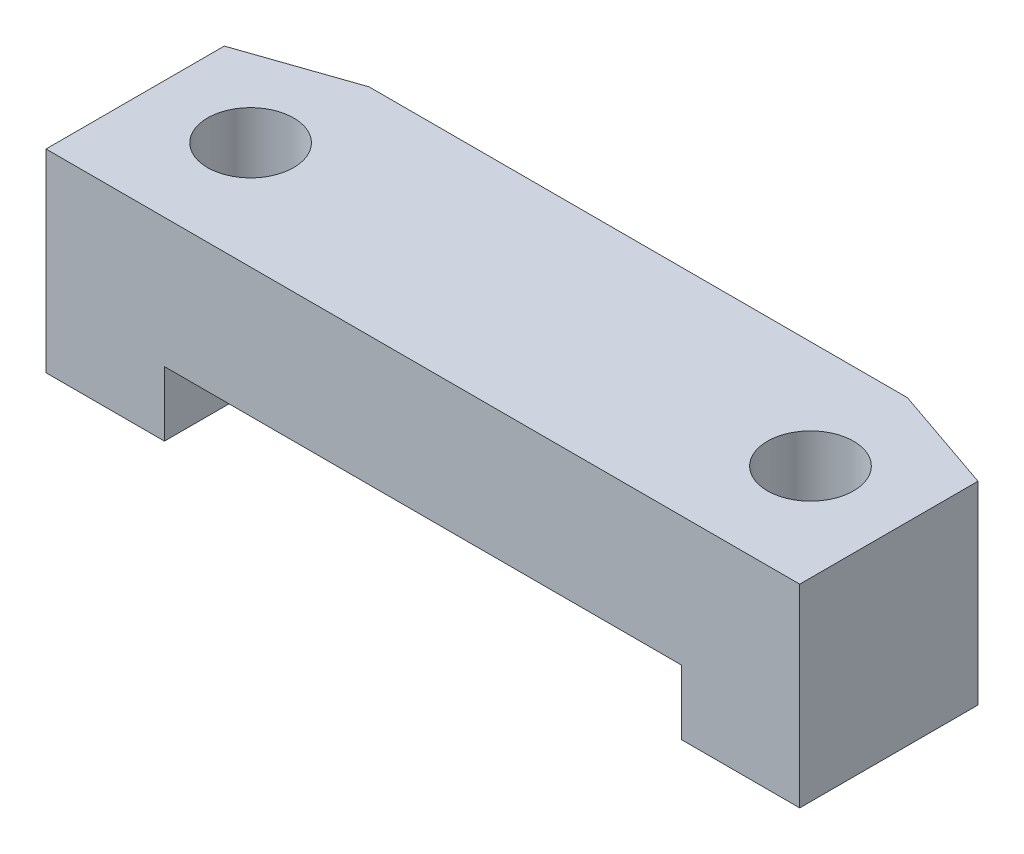
ISO-10303-21;
HEADER;
FILE_DESCRIPTION(('STEP AP214'),'2;1');
FILE_NAME('part.step','',(''),(''),'','','');
FILE_SCHEMA(('AUTOMOTIVE_DESIGN { 1 0 10303 214 1 1 1 1 }'));
ENDSEC;
DATA;
#1=APPLICATION_CONTEXT('core data for automotive mechanical design processes');
#2=APPLICATION_PROTOCOL_DEFINITION('international standard','automotive_design',2000,#1);
#3=PRODUCT_CONTEXT('',#1,'mechanical');
#4=PRODUCT('Part','Part','',(#3));
#5=PRODUCT_RELATED_PRODUCT_CATEGORY('part','',(#4));
#6=PRODUCT_DEFINITION_FORMATION('','',#4);
#7=PRODUCT_DEFINITION_CONTEXT('part definition',#1,'design');
#8=PRODUCT_DEFINITION('design','',#6,#7);
#9=PRODUCT_DEFINITION_SHAPE('','',#8);
#10=(LENGTH_UNIT() NAMED_UNIT(*) SI_UNIT(.MILLI.,.METRE.));
#11=(NAMED_UNIT(*) PLANE_ANGLE_UNIT() SI_UNIT($,.RADIAN.));
#12=(NAMED_UNIT(*) SI_UNIT($,.STERADIAN.) SOLID_ANGLE_UNIT());
#13=UNCERTAINTY_MEASURE_WITH_UNIT(LENGTH_MEASURE(1.E-05),#10,'distance_accuracy_value','');
#14=(GEOMETRIC_REPRESENTATION_CONTEXT(3) GLOBAL_UNCERTAINTY_ASSIGNED_CONTEXT((#13)) GLOBAL_UNIT_ASSIGNED_CONTEXT((#10,
#11,#12)) REPRESENTATION_CONTEXT('',''));
#15=CARTESIAN_POINT('',(0.,0.,0.));
#16=DIRECTION('',(0.,0.,1.));
#17=DIRECTION('',(1.,0.,0.));
#18=AXIS2_PLACEMENT_3D('',#15,#16,#17);
#19=CARTESIAN_POINT('',(0.,0.,5.));
#20=DIRECTION('',(0.,1.,0.));
#21=DIRECTION('',(0.,0.,1.));
#22=AXIS2_PLACEMENT_3D('',#19,#20,#21);
#23=PLANE('',#22);
#24=DIRECTION('',(1.,0.,0.));
#25=VECTOR('',#24,1.);
#26=CARTESIAN_POINT('',(0.,0.,0.));
#27=LINE('',#26,#25);
#28=CARTESIAN_POINT('',(14.75,0.,0.));
#29=VERTEX_POINT('',#28);
#30=CARTESIAN_POINT('',(15.,0.,0.));
#31=VERTEX_POINT('',#30);
#32=EDGE_CURVE('E170',#29,#31,#27,.T.);
#33=ORIENTED_EDGE('',*,*,#32,.T.);
#34=DIRECTION('',(0.945518575599317,0.,0.325568154457155));
#35=VECTOR('',#34,1.);
#36=CARTESIAN_POINT('',(17.5,0.,0.860819033224168));
#37=LINE('',#36,#35);
#38=CARTESIAN_POINT('',(17.5,0.,0.860819033224168));
#39=VERTEX_POINT('',#38);
#40=EDGE_CURVE('E13',#31,#39,#37,.T.);
#41=ORIENTED_EDGE('',*,*,#40,.T.);
#42=DIRECTION('',(0.,0.,-1.));
#43=VECTOR('',#42,1.);
#44=CARTESIAN_POINT('',(17.5,0.,5.));
#45=LINE('',#44,#43);
#46=CARTESIAN_POINT('',(17.5,0.,5.));
#47=VERTEX_POINT('',#46);
#48=EDGE_CURVE('E227',#47,#39,#45,.T.);
#49=ORIENTED_EDGE('',*,*,#48,.F.);
#50=DIRECTION('',(1.,0.,0.));
#51=VECTOR('',#50,1.);
#52=CARTESIAN_POINT('',(0.,0.,5.));
#53=LINE('',#52,#51);
#54=CARTESIAN_POINT('',(14.75,0.,5.));
#55=VERTEX_POINT('',#54);
#56=EDGE_CURVE('E208',#55,#47,#53,.T.);
#57=ORIENTED_EDGE('',*,*,#56,.F.);
#58=DIRECTION('',(0.,0.,1.));
#59=VECTOR('',#58,1.);
#60=CARTESIAN_POINT('',(14.75,0.,0.));
#61=LINE('',#60,#59);
#62=CARTESIAN_POINT('',(14.75,0.,3.36602540378444));
#63=VERTEX_POINT('',#62);
#64=EDGE_CURVE('E186',#63,#55,#61,.T.);
#65=ORIENTED_EDGE('',*,*,#64,.F.);
#66=CARTESIAN_POINT('',(15.25,0.,2.5));
#67=DIRECTION('',(0.,1.,0.));
#68=DIRECTION('',(0.,0.,1.));
#69=AXIS2_PLACEMENT_3D('',#66,#67,#68);
#70=CIRCLE('',#69,1.);
#71=CARTESIAN_POINT('',(14.75,0.,1.63397459621556));
#72=VERTEX_POINT('',#71);
#73=EDGE_CURVE('E194',#63,#72,#70,.T.);
#74=ORIENTED_EDGE('',*,*,#73,.T.);
#75=EDGE_CURVE('E183',#29,#72,#61,.T.);
#76=ORIENTED_EDGE('',*,*,#75,.F.);
#77=EDGE_LOOP('',(#33,#41,#49,#57,#65,#74,#76));
#78=FACE_BOUND('',#77,.T.);
#79=ADVANCED_FACE('F43',(#78),#23,.F.);
#80=DIRECTION('',(0.,0.,-1.));
#81=VECTOR('',#80,1.);
#82=CARTESIAN_POINT('',(0.,0.,5.));
#83=LINE('',#82,#81);
#84=CARTESIAN_POINT('',(0.,0.,5.));
#85=VERTEX_POINT('',#84);
#86=CARTESIAN_POINT('',(0.,0.,0.860819033224167));
#87=VERTEX_POINT('',#86);
#88=EDGE_CURVE('E229',#85,#87,#83,.T.);
#89=ORIENTED_EDGE('',*,*,#88,.T.);
#90=DIRECTION('',(0.945518575599318,0.,-0.325568154457155));
#91=VECTOR('',#90,1.);
#92=CARTESIAN_POINT('',(0.,0.,0.860819033224167));
#93=LINE('',#92,#91);
#94=CARTESIAN_POINT('',(2.50000000000003,0.,0.));
#95=VERTEX_POINT('',#94);
#96=EDGE_CURVE('E244',#87,#95,#93,.T.);
#97=ORIENTED_EDGE('',*,*,#96,.T.);
#98=CARTESIAN_POINT('',(2.75,0.,0.));
#99=VERTEX_POINT('',#98);
#100=EDGE_CURVE('E218',#95,#99,#27,.T.);
#101=ORIENTED_EDGE('',*,*,#100,.T.);
#102=DIRECTION('',(0.,0.,1.));
#103=VECTOR('',#102,1.);
#104=CARTESIAN_POINT('',(2.75,0.,0.));
#105=LINE('',#104,#103);
#106=CARTESIAN_POINT('',(2.75,0.,1.63397459621556));
#107=VERTEX_POINT('',#106);
#108=EDGE_CURVE('E187',#99,#107,#105,.T.);
#109=ORIENTED_EDGE('',*,*,#108,.T.);
#110=CARTESIAN_POINT('',(2.25,0.,2.5));
#111=DIRECTION('',(0.,1.,0.));
#112=DIRECTION('',(0.,0.,1.));
#113=AXIS2_PLACEMENT_3D('',#110,#111,#112);
#114=CIRCLE('',#113,1.);
#115=CARTESIAN_POINT('',(2.75,0.,3.36602540378444));
#116=VERTEX_POINT('',#115);
#117=EDGE_CURVE('E200',#107,#116,#114,.T.);
#118=ORIENTED_EDGE('',*,*,#117,.T.);
#119=CARTESIAN_POINT('',(2.75,0.,5.));
#120=VERTEX_POINT('',#119);
#121=EDGE_CURVE('E190',#116,#120,#105,.T.);
#122=ORIENTED_EDGE('',*,*,#121,.T.);
#123=EDGE_CURVE('E210',#85,#120,#53,.T.);
#124=ORIENTED_EDGE('',*,*,#123,.F.);
#125=EDGE_LOOP('',(#89,#97,#101,#109,#118,#122,#124));
#126=FACE_BOUND('',#125,.T.);
#127=ADVANCED_FACE('F269',(#126),#23,.F.);
#128=CARTESIAN_POINT('',(0.,4.5,5.));
#129=DIRECTION('',(0.,0.,-1.));
#130=DIRECTION('',(-1.,0.,0.));
#131=AXIS2_PLACEMENT_3D('',#128,#129,#130);
#132=PLANE('',#131);
#133=DIRECTION('',(0.,-1.,0.));
#134=VECTOR('',#133,1.);
#135=CARTESIAN_POINT('',(14.75,-11.946046929336,5.));
#136=LINE('',#135,#134);
#137=CARTESIAN_POINT('',(14.75,1.5,5.));
#138=VERTEX_POINT('',#137);
#139=EDGE_CURVE('E178',#138,#55,#136,.T.);
#140=ORIENTED_EDGE('',*,*,#139,.T.);
#141=ORIENTED_EDGE('',*,*,#56,.T.);
#142=DIRECTION('',(0.,1.,0.));
#143=VECTOR('',#142,1.);
#144=CARTESIAN_POINT('',(17.5,0.,5.));
#145=LINE('',#144,#143);
#146=CARTESIAN_POINT('',(17.5,4.5,5.));
#147=VERTEX_POINT('',#146);
#148=EDGE_CURVE('E213',#47,#147,#145,.T.);
#149=ORIENTED_EDGE('',*,*,#148,.T.);
#150=DIRECTION('',(-1.,0.,0.));
#151=VECTOR('',#150,1.);
#152=CARTESIAN_POINT('',(0.,4.5,5.));
#153=LINE('',#152,#151);
#154=CARTESIAN_POINT('',(0.,4.5,5.));
#155=VERTEX_POINT('',#154);
#156=EDGE_CURVE('E215',#147,#155,#153,.T.);
#157=ORIENTED_EDGE('',*,*,#156,.T.);
#158=DIRECTION('',(0.,-1.,0.));
#159=VECTOR('',#158,1.);
#160=CARTESIAN_POINT('',(0.,0.,5.));
#161=LINE('',#160,#159);
#162=EDGE_CURVE('E205',#155,#85,#161,.T.);
#163=ORIENTED_EDGE('',*,*,#162,.T.);
#164=ORIENTED_EDGE('',*,*,#123,.T.);
#165=DIRECTION('',(0.,1.,0.));
#166=VECTOR('',#165,1.);
#167=CARTESIAN_POINT('',(2.75,-11.946046929336,5.));
#168=LINE('',#167,#166);
#169=CARTESIAN_POINT('',(2.75,1.5,5.));
#170=VERTEX_POINT('',#169);
#171=EDGE_CURVE('E171',#120,#170,#168,.T.);
#172=ORIENTED_EDGE('',*,*,#171,.T.);
#173=DIRECTION('',(1.,0.,0.));
#174=VECTOR('',#173,1.);
#175=CARTESIAN_POINT('',(8.75,1.5,5.));
#176=LINE('',#175,#174);
#177=EDGE_CURVE('E174',#170,#138,#176,.T.);
#178=ORIENTED_EDGE('',*,*,#177,.T.);
#179=EDGE_LOOP('',(#140,#141,#149,#157,#163,#164,#172,#178));
#180=FACE_BOUND('',#179,.T.);
#181=ADVANCED_FACE('F263',(#180),#132,.F.);
#182=CARTESIAN_POINT('',(0.,4.5,0.));
#183=DIRECTION('',(0.,0.,-1.));
#184=DIRECTION('',(-1.,0.,0.));
#185=AXIS2_PLACEMENT_3D('',#182,#183,#184);
#186=PLANE('',#185);
#187=ORIENTED_EDGE('',*,*,#100,.F.);
#188=DIRECTION('',(0.,1.,0.));
#189=VECTOR('',#188,1.);
#190=CARTESIAN_POINT('',(2.50000000000003,4.5,0.));
#191=LINE('',#190,#189);
#192=CARTESIAN_POINT('',(2.50000000000003,4.5,0.));
#193=VERTEX_POINT('',#192);
#194=EDGE_CURVE('E248',#95,#193,#191,.T.);
#195=ORIENTED_EDGE('',*,*,#194,.T.);
#196=DIRECTION('',(-1.,0.,0.));
#197=VECTOR('',#196,1.);
#198=CARTESIAN_POINT('',(0.,4.5,0.));
#199=LINE('',#198,#197);
#200=CARTESIAN_POINT('',(15.,4.5,0.));
#201=VERTEX_POINT('',#200);
#202=EDGE_CURVE('E209',#201,#193,#199,.T.);
#203=ORIENTED_EDGE('',*,*,#202,.F.);
#204=DIRECTION('',(0.,-1.,0.));
#205=VECTOR('',#204,1.);
#206=CARTESIAN_POINT('',(15.,0.,0.));
#207=LINE('',#206,#205);
#208=EDGE_CURVE('E246',#201,#31,#207,.T.);
#209=ORIENTED_EDGE('',*,*,#208,.T.);
#210=ORIENTED_EDGE('',*,*,#32,.F.);
#211=DIRECTION('',(0.,-1.,0.));
#212=VECTOR('',#211,1.);
#213=CARTESIAN_POINT('',(14.75,-11.946046929336,0.));
#214=LINE('',#213,#212);
#215=CARTESIAN_POINT('',(14.75,1.5,0.));
#216=VERTEX_POINT('',#215);
#217=EDGE_CURVE('E156',#216,#29,#214,.T.);
#218=ORIENTED_EDGE('',*,*,#217,.F.);
#219=DIRECTION('',(1.,0.,0.));
#220=VECTOR('',#219,1.);
#221=CARTESIAN_POINT('',(8.75,1.5,0.));
#222=LINE('',#221,#220);
#223=CARTESIAN_POINT('',(2.75,1.5,0.));
#224=VERTEX_POINT('',#223);
#225=EDGE_CURVE('E145',#224,#216,#222,.T.);
#226=ORIENTED_EDGE('',*,*,#225,.F.);
#227=DIRECTION('',(0.,1.,0.));
#228=VECTOR('',#227,1.);
#229=CARTESIAN_POINT('',(2.75,-11.946046929336,0.));
#230=LINE('',#229,#228);
#231=EDGE_CURVE('E155',#99,#224,#230,.T.);
#232=ORIENTED_EDGE('',*,*,#231,.F.);
#233=EDGE_LOOP('',(#187,#195,#203,#209,#210,#218,#226,#232));
#234=FACE_BOUND('',#233,.T.);
#235=ADVANCED_FACE('F169',(#234),#186,.T.);
#236=CARTESIAN_POINT('',(2.25,0.,2.5));
#237=DIRECTION('',(0.,1.,0.));
#238=DIRECTION('',(0.,0.,1.));
#239=AXIS2_PLACEMENT_3D('',#236,#237,#238);
#240=CYLINDRICAL_SURFACE('',#239,1.);
#241=CARTESIAN_POINT('',(2.25,4.5,2.5));
#242=DIRECTION('',(0.,1.,0.));
#243=DIRECTION('',(0.,0.,1.));
#244=AXIS2_PLACEMENT_3D('',#241,#242,#243);
#245=CIRCLE('',#244,1.);
#246=CARTESIAN_POINT('',(2.25,4.5,3.5));
#247=VERTEX_POINT('',#246);
#248=EDGE_CURVE('E197',#247,#247,#245,.T.);
#249=ORIENTED_EDGE('',*,*,#248,.T.);
#250=EDGE_LOOP('',(#249));
#251=FACE_BOUND('',#250,.T.);
#252=DIRECTION('',(0.,1.,0.));
#253=VECTOR('',#252,1.);
#254=CARTESIAN_POINT('',(2.75,0.,1.63397459621556));
#255=LINE('',#254,#253);
#256=CARTESIAN_POINT('',(2.75,1.5,1.63397459621556));
#257=VERTEX_POINT('',#256);
#258=EDGE_CURVE('E239',#257,#107,#255,.F.);
#259=ORIENTED_EDGE('',*,*,#258,.F.);
#260=CARTESIAN_POINT('',(2.25,1.5,2.5));
#261=DIRECTION('',(0.,-1.,0.));
#262=DIRECTION('',(0.,0.,-1.));
#263=AXIS2_PLACEMENT_3D('',#260,#261,#262);
#264=CIRCLE('',#263,1.);
#265=CARTESIAN_POINT('',(2.75,1.5,3.36602540378444));
#266=VERTEX_POINT('',#265);
#267=EDGE_CURVE('E185',#266,#257,#264,.F.);
#268=ORIENTED_EDGE('',*,*,#267,.F.);
#269=DIRECTION('',(0.,1.,0.));
#270=VECTOR('',#269,1.);
#271=CARTESIAN_POINT('',(2.75,0.,3.36602540378444));
#272=LINE('',#271,#270);
#273=EDGE_CURVE('E237',#116,#266,#272,.T.);
#274=ORIENTED_EDGE('',*,*,#273,.F.);
#275=ORIENTED_EDGE('',*,*,#117,.F.);
#276=EDGE_LOOP('',(#259,#268,#274,#275));
#277=FACE_BOUND('',#276,.T.);
#278=ADVANCED_FACE('F307',(#251,#277),#240,.F.);
#279=CARTESIAN_POINT('',(15.25,0.,2.5));
#280=DIRECTION('',(0.,1.,0.));
#281=DIRECTION('',(0.,0.,1.));
#282=AXIS2_PLACEMENT_3D('',#279,#280,#281);
#283=CYLINDRICAL_SURFACE('',#282,1.);
#284=CARTESIAN_POINT('',(15.25,4.5,2.5));
#285=DIRECTION('',(0.,1.,0.));
#286=DIRECTION('',(0.,0.,1.));
#287=AXIS2_PLACEMENT_3D('',#284,#285,#286);
#288=CIRCLE('',#287,1.);
#289=CARTESIAN_POINT('',(15.25,4.5,3.5));
#290=VERTEX_POINT('',#289);
#291=EDGE_CURVE('E193',#290,#290,#288,.T.);
#292=ORIENTED_EDGE('',*,*,#291,.T.);
#293=EDGE_LOOP('',(#292));
#294=FACE_BOUND('',#293,.T.);
#295=DIRECTION('',(0.,1.,0.));
#296=VECTOR('',#295,1.);
#297=CARTESIAN_POINT('',(14.75,0.,3.36602540378444));
#298=LINE('',#297,#296);
#299=CARTESIAN_POINT('',(14.75,1.5,3.36602540378444));
#300=VERTEX_POINT('',#299);
#301=EDGE_CURVE('E235',#300,#63,#298,.F.);
#302=ORIENTED_EDGE('',*,*,#301,.F.);
#303=CARTESIAN_POINT('',(15.25,1.5,2.5));
#304=DIRECTION('',(0.,-1.,0.));
#305=DIRECTION('',(0.,0.,-1.));
#306=AXIS2_PLACEMENT_3D('',#303,#304,#305);
#307=CIRCLE('',#306,1.);
#308=CARTESIAN_POINT('',(14.75,1.5,1.63397459621556));
#309=VERTEX_POINT('',#308);
#310=EDGE_CURVE('E232',#309,#300,#307,.F.);
#311=ORIENTED_EDGE('',*,*,#310,.F.);
#312=DIRECTION('',(0.,1.,0.));
#313=VECTOR('',#312,1.);
#314=CARTESIAN_POINT('',(14.75,0.,1.63397459621556));
#315=LINE('',#314,#313);
#316=EDGE_CURVE('E162',#72,#309,#315,.T.);
#317=ORIENTED_EDGE('',*,*,#316,.F.);
#318=ORIENTED_EDGE('',*,*,#73,.F.);
#319=EDGE_LOOP('',(#302,#311,#317,#318));
#320=FACE_BOUND('',#319,.T.);
#321=ADVANCED_FACE('F280',(#294,#320),#283,.F.);
#322=CARTESIAN_POINT('',(0.,0.,5.));
#323=DIRECTION('',(1.,0.,0.));
#324=DIRECTION('',(0.,0.,-1.));
#325=AXIS2_PLACEMENT_3D('',#322,#323,#324);
#326=PLANE('',#325);
#327=DIRECTION('',(0.,0.,-1.));
#328=VECTOR('',#327,1.);
#329=CARTESIAN_POINT('',(0.,4.5,5.));
#330=LINE('',#329,#328);
#331=CARTESIAN_POINT('',(0.,4.5,0.860819033224167));
#332=VERTEX_POINT('',#331);
#333=EDGE_CURVE('E217',#155,#332,#330,.T.);
#334=ORIENTED_EDGE('',*,*,#333,.T.);
#335=DIRECTION('',(0.,-1.,0.));
#336=VECTOR('',#335,1.);
#337=CARTESIAN_POINT('',(0.,0.,0.860819033224167));
#338=LINE('',#337,#336);
#339=EDGE_CURVE('E241',#332,#87,#338,.T.);
#340=ORIENTED_EDGE('',*,*,#339,.T.);
#341=ORIENTED_EDGE('',*,*,#88,.F.);
#342=ORIENTED_EDGE('',*,*,#162,.F.);
#343=EDGE_LOOP('',(#334,#340,#341,#342));
#344=FACE_BOUND('',#343,.T.);
#345=ADVANCED_FACE('F278',(#344),#326,.F.);
#346=CARTESIAN_POINT('',(17.5,0.,5.));
#347=DIRECTION('',(-1.,0.,0.));
#348=DIRECTION('',(0.,0.,1.));
#349=AXIS2_PLACEMENT_3D('',#346,#347,#348);
#350=PLANE('',#349);
#351=ORIENTED_EDGE('',*,*,#48,.T.);
#352=DIRECTION('',(0.,1.,0.));
#353=VECTOR('',#352,1.);
#354=CARTESIAN_POINT('',(17.5,4.5,0.860819033224168));
#355=LINE('',#354,#353);
#356=CARTESIAN_POINT('',(17.5,4.5,0.860819033224168));
#357=VERTEX_POINT('',#356);
#358=EDGE_CURVE('E51',#39,#357,#355,.T.);
#359=ORIENTED_EDGE('',*,*,#358,.T.);
#360=DIRECTION('',(0.,0.,-1.));
#361=VECTOR('',#360,1.);
#362=CARTESIAN_POINT('',(17.5,4.5,5.));
#363=LINE('',#362,#361);
#364=EDGE_CURVE('E224',#147,#357,#363,.T.);
#365=ORIENTED_EDGE('',*,*,#364,.F.);
#366=ORIENTED_EDGE('',*,*,#148,.F.);
#367=EDGE_LOOP('',(#351,#359,#365,#366));
#368=FACE_BOUND('',#367,.T.);
#369=ADVANCED_FACE('F254',(#368),#350,.F.);
#370=CARTESIAN_POINT('',(0.,4.5,5.));
#371=DIRECTION('',(0.,-1.,0.));
#372=DIRECTION('',(0.,0.,-1.));
#373=AXIS2_PLACEMENT_3D('',#370,#371,#372);
#374=PLANE('',#373);
#375=ORIENTED_EDGE('',*,*,#291,.F.);
#376=EDGE_LOOP('',(#375));
#377=FACE_BOUND('',#376,.T.);
#378=ORIENTED_EDGE('',*,*,#248,.F.);
#379=EDGE_LOOP('',(#378));
#380=FACE_BOUND('',#379,.T.);
#381=ORIENTED_EDGE('',*,*,#202,.T.);
#382=DIRECTION('',(-0.945518575599318,0.,0.325568154457155));
#383=VECTOR('',#382,1.);
#384=CARTESIAN_POINT('',(0.,4.5,0.860819033224167));
#385=LINE('',#384,#383);
#386=EDGE_CURVE('E251',#193,#332,#385,.T.);
#387=ORIENTED_EDGE('',*,*,#386,.T.);
#388=ORIENTED_EDGE('',*,*,#333,.F.);
#389=ORIENTED_EDGE('',*,*,#156,.F.);
#390=ORIENTED_EDGE('',*,*,#364,.T.);
#391=DIRECTION('',(-0.945518575599317,0.,-0.325568154457155));
#392=VECTOR('',#391,1.);
#393=CARTESIAN_POINT('',(17.5,4.5,0.860819033224168));
#394=LINE('',#393,#392);
#395=EDGE_CURVE('E64',#357,#201,#394,.T.);
#396=ORIENTED_EDGE('',*,*,#395,.T.);
#397=EDGE_LOOP('',(#381,#387,#388,#389,#390,#396));
#398=FACE_BOUND('',#397,.T.);
#399=ADVANCED_FACE('F258',(#377,#380,#398),#374,.F.);
#400=CARTESIAN_POINT('',(2.75,-11.946046929336,0.));
#401=DIRECTION('',(1.,0.,0.));
#402=DIRECTION('',(0.,0.,-1.));
#403=AXIS2_PLACEMENT_3D('',#400,#401,#402);
#404=PLANE('',#403);
#405=ORIENTED_EDGE('',*,*,#258,.T.);
#406=ORIENTED_EDGE('',*,*,#108,.F.);
#407=ORIENTED_EDGE('',*,*,#231,.T.);
#408=DIRECTION('',(0.,0.,1.));
#409=VECTOR('',#408,1.);
#410=CARTESIAN_POINT('',(2.75,1.5,0.));
#411=LINE('',#410,#409);
#412=EDGE_CURVE('E151',#224,#257,#411,.T.);
#413=ORIENTED_EDGE('',*,*,#412,.T.);
#414=EDGE_LOOP('',(#405,#406,#407,#413));
#415=FACE_BOUND('',#414,.T.);
#416=ADVANCED_FACE('F321',(#415),#404,.T.);
#417=ORIENTED_EDGE('',*,*,#273,.T.);
#418=EDGE_CURVE('E164',#266,#170,#411,.T.);
#419=ORIENTED_EDGE('',*,*,#418,.T.);
#420=ORIENTED_EDGE('',*,*,#171,.F.);
#421=ORIENTED_EDGE('',*,*,#121,.F.);
#422=EDGE_LOOP('',(#417,#419,#420,#421));
#423=FACE_BOUND('',#422,.T.);
#424=ADVANCED_FACE('F296',(#423),#404,.T.);
#425=CARTESIAN_POINT('',(14.75,-11.946046929336,0.));
#426=DIRECTION('',(-1.,0.,0.));
#427=DIRECTION('',(0.,0.,1.));
#428=AXIS2_PLACEMENT_3D('',#425,#426,#427);
#429=PLANE('',#428);
#430=ORIENTED_EDGE('',*,*,#301,.T.);
#431=ORIENTED_EDGE('',*,*,#64,.T.);
#432=ORIENTED_EDGE('',*,*,#139,.F.);
#433=DIRECTION('',(0.,0.,1.));
#434=VECTOR('',#433,1.);
#435=CARTESIAN_POINT('',(14.75,1.5,0.));
#436=LINE('',#435,#434);
#437=EDGE_CURVE('E165',#300,#138,#436,.T.);
#438=ORIENTED_EDGE('',*,*,#437,.F.);
#439=EDGE_LOOP('',(#430,#431,#432,#438));
#440=FACE_BOUND('',#439,.T.);
#441=ADVANCED_FACE('F303',(#440),#429,.T.);
#442=ORIENTED_EDGE('',*,*,#316,.T.);
#443=EDGE_CURVE('E148',#216,#309,#436,.T.);
#444=ORIENTED_EDGE('',*,*,#443,.F.);
#445=ORIENTED_EDGE('',*,*,#217,.T.);
#446=ORIENTED_EDGE('',*,*,#75,.T.);
#447=EDGE_LOOP('',(#442,#444,#445,#446));
#448=FACE_BOUND('',#447,.T.);
#449=ADVANCED_FACE('F159',(#448),#429,.T.);
#450=CARTESIAN_POINT('',(8.75,1.5,0.));
#451=DIRECTION('',(0.,-1.,0.));
#452=DIRECTION('',(0.,0.,-1.));
#453=AXIS2_PLACEMENT_3D('',#450,#451,#452);
#454=PLANE('',#453);
#455=ORIENTED_EDGE('',*,*,#267,.T.);
#456=ORIENTED_EDGE('',*,*,#412,.F.);
#457=ORIENTED_EDGE('',*,*,#225,.T.);
#458=ORIENTED_EDGE('',*,*,#443,.T.);
#459=ORIENTED_EDGE('',*,*,#310,.T.);
#460=ORIENTED_EDGE('',*,*,#437,.T.);
#461=ORIENTED_EDGE('',*,*,#177,.F.);
#462=ORIENTED_EDGE('',*,*,#418,.F.);
#463=EDGE_LOOP('',(#455,#456,#457,#458,#459,#460,#461,#462));
#464=FACE_BOUND('',#463,.T.);
#465=ADVANCED_FACE('F147',(#464),#454,.T.);
#466=CARTESIAN_POINT('',(0.,0.,0.860819033224167));
#467=DIRECTION('',(-0.325568154457155,0.,-0.945518575599318));
#468=DIRECTION('',(-0.945518575599318,0.,0.325568154457155));
#469=AXIS2_PLACEMENT_3D('',#466,#467,#468);
#470=PLANE('',#469);
#471=ORIENTED_EDGE('',*,*,#386,.F.);
#472=ORIENTED_EDGE('',*,*,#194,.F.);
#473=ORIENTED_EDGE('',*,*,#96,.F.);
#474=ORIENTED_EDGE('',*,*,#339,.F.);
#475=EDGE_LOOP('',(#471,#472,#473,#474));
#476=FACE_BOUND('',#475,.T.);
#477=ADVANCED_FACE('F282',(#476),#470,.T.);
#478=CARTESIAN_POINT('',(17.5,0.,0.860819033224168));
#479=DIRECTION('',(0.325568154457155,0.,-0.945518575599317));
#480=DIRECTION('',(-0.945518575599317,0.,-0.325568154457155));
#481=AXIS2_PLACEMENT_3D('',#478,#479,#480);
#482=PLANE('',#481);
#483=ORIENTED_EDGE('',*,*,#40,.F.);
#484=ORIENTED_EDGE('',*,*,#208,.F.);
#485=ORIENTED_EDGE('',*,*,#395,.F.);
#486=ORIENTED_EDGE('',*,*,#358,.F.);
#487=EDGE_LOOP('',(#483,#484,#485,#486));
#488=FACE_BOUND('',#487,.T.);
#489=ADVANCED_FACE('F45',(#488),#482,.T.);
#490=CLOSED_SHELL('',(#79,#127,#181,#235,#278,#321,#345,#369,#399,#416,#424,#441,#449,#465,#477,#489));
#491=MANIFOLD_SOLID_BREP('B2',#490);
#492=ADVANCED_BREP_SHAPE_REPRESENTATION('',(#18,#491),#14);
#493=SHAPE_DEFINITION_REPRESENTATION(#9,#492);
ENDSEC;
END-ISO-10303-21;
